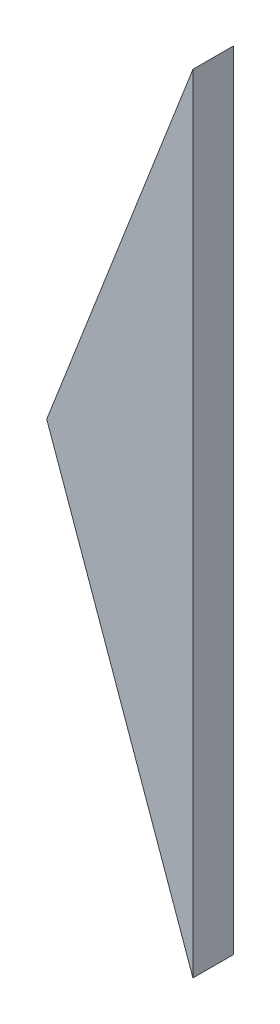
ISO-10303-21;
HEADER;
FILE_DESCRIPTION(('STEP AP214'),'2;1');
FILE_NAME('part.step','',(''),(''),'','','');
FILE_SCHEMA(('AUTOMOTIVE_DESIGN { 1 0 10303 214 1 1 1 1 }'));
ENDSEC;
DATA;
#1=APPLICATION_CONTEXT('core data for automotive mechanical design processes');
#2=APPLICATION_PROTOCOL_DEFINITION('international standard','automotive_design',2000,#1);
#3=PRODUCT_CONTEXT('',#1,'mechanical');
#4=PRODUCT('Part','Part','',(#3));
#5=PRODUCT_RELATED_PRODUCT_CATEGORY('part','',(#4));
#6=PRODUCT_DEFINITION_FORMATION('','',#4);
#7=PRODUCT_DEFINITION_CONTEXT('part definition',#1,'design');
#8=PRODUCT_DEFINITION('design','',#6,#7);
#9=PRODUCT_DEFINITION_SHAPE('','',#8);
#10=(LENGTH_UNIT() NAMED_UNIT(*) SI_UNIT(.MILLI.,.METRE.));
#11=(NAMED_UNIT(*) PLANE_ANGLE_UNIT() SI_UNIT($,.RADIAN.));
#12=(NAMED_UNIT(*) SI_UNIT($,.STERADIAN.) SOLID_ANGLE_UNIT());
#13=UNCERTAINTY_MEASURE_WITH_UNIT(LENGTH_MEASURE(1.E-05),#10,'distance_accuracy_value','');
#14=(GEOMETRIC_REPRESENTATION_CONTEXT(3) GLOBAL_UNCERTAINTY_ASSIGNED_CONTEXT((#13)) GLOBAL_UNIT_ASSIGNED_CONTEXT((#10,
#11,#12)) REPRESENTATION_CONTEXT('',''));
#15=CARTESIAN_POINT('',(0.,0.,0.));
#16=DIRECTION('',(0.,0.,1.));
#17=DIRECTION('',(1.,0.,0.));
#18=AXIS2_PLACEMENT_3D('',#15,#16,#17);
#19=CARTESIAN_POINT('',(-14.87341289222,-96.7698567959238,-3.));
#20=DIRECTION('',(-0.942132692088365,-0.335240198213652,0.));
#21=DIRECTION('',(0.335240198213652,-0.942132692088366,0.));
#22=AXIS2_PLACEMENT_3D('',#19,#20,#21);
#23=PLANE('',#22);
#24=DIRECTION('',(0.335240198213652,-0.942132692088366,0.));
#25=VECTOR('',#24,1.);
#26=CARTESIAN_POINT('',(-14.87341289222,-96.7698567959238,0.));
#27=LINE('',#26,#25);
#28=CARTESIAN_POINT('',(-25.7430664156186,-66.2226372481627,0.));
#29=VERTEX_POINT('',#28);
#30=CARTESIAN_POINT('',(-14.87341289222,-96.7698567959238,0.));
#31=VERTEX_POINT('',#30);
#32=EDGE_CURVE('E85',#29,#31,#27,.T.);
#33=ORIENTED_EDGE('',*,*,#32,.F.);
#34=DIRECTION('',(0.,0.,1.));
#35=VECTOR('',#34,1.);
#36=CARTESIAN_POINT('',(-25.7430664156186,-66.2226372481627,-3.));
#37=LINE('',#36,#35);
#38=CARTESIAN_POINT('',(-25.7430664156186,-66.2226372481627,-3.));
#39=VERTEX_POINT('',#38);
#40=EDGE_CURVE('E11',#39,#29,#37,.T.);
#41=ORIENTED_EDGE('',*,*,#40,.F.);
#42=DIRECTION('',(0.335240198213652,-0.942132692088366,0.));
#43=VECTOR('',#42,1.);
#44=CARTESIAN_POINT('',(-14.87341289222,-96.7698567959238,-3.));
#45=LINE('',#44,#43);
#46=CARTESIAN_POINT('',(-14.87341289222,-96.7698567959238,-3.));
#47=VERTEX_POINT('',#46);
#48=EDGE_CURVE('E77',#39,#47,#45,.T.);
#49=ORIENTED_EDGE('',*,*,#48,.T.);
#50=DIRECTION('',(0.,0.,1.));
#51=VECTOR('',#50,1.);
#52=CARTESIAN_POINT('',(-14.87341289222,-96.7698567959238,-3.));
#53=LINE('',#52,#51);
#54=EDGE_CURVE('E36',#47,#31,#53,.T.);
#55=ORIENTED_EDGE('',*,*,#54,.T.);
#56=EDGE_LOOP('',(#33,#41,#49,#55));
#57=FACE_BOUND('',#56,.T.);
#58=ADVANCED_FACE('F33',(#57),#23,.T.);
#59=CARTESIAN_POINT('',(-25.7430664156186,-66.2226372481627,-3.));
#60=DIRECTION('',(-0.932053069710606,0.362321784113289,0.));
#61=DIRECTION('',(-0.362321784113289,-0.932053069710606,0.));
#62=AXIS2_PLACEMENT_3D('',#59,#60,#61);
#63=PLANE('',#62);
#64=DIRECTION('',(-0.362321784113289,-0.932053069710606,0.));
#65=VECTOR('',#64,1.);
#66=CARTESIAN_POINT('',(-25.7430664156186,-66.2226372481627,0.));
#67=LINE('',#66,#65);
#68=CARTESIAN_POINT('',(-14.87341289222,-38.2610451568445,0.));
#69=VERTEX_POINT('',#68);
#70=EDGE_CURVE('E79',#69,#29,#67,.T.);
#71=ORIENTED_EDGE('',*,*,#70,.F.);
#72=DIRECTION('',(0.,0.,1.));
#73=VECTOR('',#72,1.);
#74=CARTESIAN_POINT('',(-14.87341289222,-38.2610451568445,-3.));
#75=LINE('',#74,#73);
#76=CARTESIAN_POINT('',(-14.87341289222,-38.2610451568445,-3.));
#77=VERTEX_POINT('',#76);
#78=EDGE_CURVE('E42',#77,#69,#75,.T.);
#79=ORIENTED_EDGE('',*,*,#78,.F.);
#80=DIRECTION('',(-0.362321784113289,-0.932053069710606,0.));
#81=VECTOR('',#80,1.);
#82=CARTESIAN_POINT('',(-25.7430664156186,-66.2226372481627,-3.));
#83=LINE('',#82,#81);
#84=EDGE_CURVE('E74',#77,#39,#83,.T.);
#85=ORIENTED_EDGE('',*,*,#84,.T.);
#86=ORIENTED_EDGE('',*,*,#40,.T.);
#87=EDGE_LOOP('',(#71,#79,#85,#86));
#88=FACE_BOUND('',#87,.T.);
#89=ADVANCED_FACE('F89',(#88),#63,.T.);
#90=CARTESIAN_POINT('',(-14.87341289222,-38.2610451568445,-3.));
#91=DIRECTION('',(1.,0.,0.));
#92=DIRECTION('',(0.,1.,0.));
#93=AXIS2_PLACEMENT_3D('',#90,#91,#92);
#94=PLANE('',#93);
#95=DIRECTION('',(0.,1.,0.));
#96=VECTOR('',#95,1.);
#97=CARTESIAN_POINT('',(-14.87341289222,-38.2610451568445,0.));
#98=LINE('',#97,#96);
#99=EDGE_CURVE('E72',#31,#69,#98,.T.);
#100=ORIENTED_EDGE('',*,*,#99,.F.);
#101=ORIENTED_EDGE('',*,*,#54,.F.);
#102=DIRECTION('',(0.,1.,0.));
#103=VECTOR('',#102,1.);
#104=CARTESIAN_POINT('',(-14.87341289222,-38.2610451568445,-3.));
#105=LINE('',#104,#103);
#106=EDGE_CURVE('E70',#47,#77,#105,.T.);
#107=ORIENTED_EDGE('',*,*,#106,.T.);
#108=ORIENTED_EDGE('',*,*,#78,.T.);
#109=EDGE_LOOP('',(#100,#101,#107,#108));
#110=FACE_BOUND('',#109,.T.);
#111=ADVANCED_FACE('F69',(#110),#94,.T.);
#112=CARTESIAN_POINT('',(0.,0.,-3.));
#113=DIRECTION('',(0.,0.,-1.));
#114=DIRECTION('',(-1.,0.,0.));
#115=AXIS2_PLACEMENT_3D('',#112,#113,#114);
#116=PLANE('',#115);
#117=ORIENTED_EDGE('',*,*,#48,.F.);
#118=ORIENTED_EDGE('',*,*,#84,.F.);
#119=ORIENTED_EDGE('',*,*,#106,.F.);
#120=EDGE_LOOP('',(#117,#118,#119));
#121=FACE_BOUND('',#120,.T.);
#122=ADVANCED_FACE('F76',(#121),#116,.T.);
#123=CARTESIAN_POINT('',(0.,0.,0.));
#124=DIRECTION('',(0.,0.,-1.));
#125=DIRECTION('',(-1.,0.,0.));
#126=AXIS2_PLACEMENT_3D('',#123,#124,#125);
#127=PLANE('',#126);
#128=ORIENTED_EDGE('',*,*,#32,.T.);
#129=ORIENTED_EDGE('',*,*,#99,.T.);
#130=ORIENTED_EDGE('',*,*,#70,.T.);
#131=EDGE_LOOP('',(#128,#129,#130));
#132=FACE_BOUND('',#131,.T.);
#133=ADVANCED_FACE('F88',(#132),#127,.F.);
#134=CLOSED_SHELL('',(#58,#89,#111,#122,#133));
#135=MANIFOLD_SOLID_BREP('B2',#134);
#136=ADVANCED_BREP_SHAPE_REPRESENTATION('',(#18,#135),#14);
#137=SHAPE_DEFINITION_REPRESENTATION(#9,#136);
ENDSEC;
END-ISO-10303-21;
